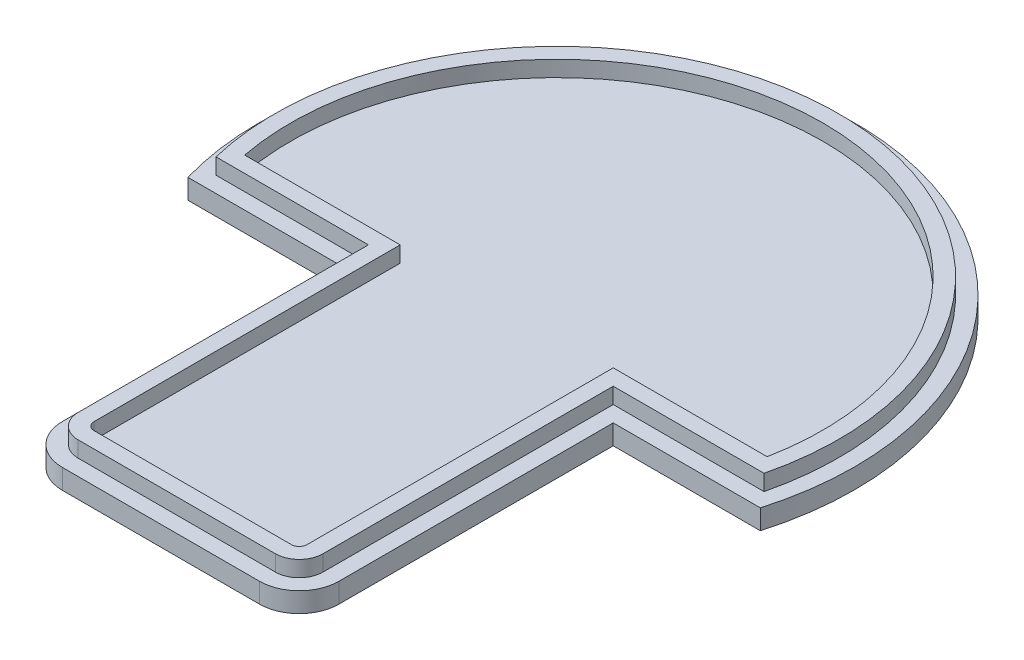
ISO-10303-21;
HEADER;
FILE_DESCRIPTION(('STEP AP214'),'2;1');
FILE_NAME('part.step','',(''),(''),'','','');
FILE_SCHEMA(('AUTOMOTIVE_DESIGN { 1 0 10303 214 1 1 1 1 }'));
ENDSEC;
DATA;
#1=APPLICATION_CONTEXT('core data for automotive mechanical design processes');
#2=APPLICATION_PROTOCOL_DEFINITION('international standard','automotive_design',2000,#1);
#3=PRODUCT_CONTEXT('',#1,'mechanical');
#4=PRODUCT('Part','Part','',(#3));
#5=PRODUCT_RELATED_PRODUCT_CATEGORY('part','',(#4));
#6=PRODUCT_DEFINITION_FORMATION('','',#4);
#7=PRODUCT_DEFINITION_CONTEXT('part definition',#1,'design');
#8=PRODUCT_DEFINITION('design','',#6,#7);
#9=PRODUCT_DEFINITION_SHAPE('','',#8);
#10=(LENGTH_UNIT() NAMED_UNIT(*) SI_UNIT(.MILLI.,.METRE.));
#11=(NAMED_UNIT(*) PLANE_ANGLE_UNIT() SI_UNIT($,.RADIAN.));
#12=(NAMED_UNIT(*) SI_UNIT($,.STERADIAN.) SOLID_ANGLE_UNIT());
#13=UNCERTAINTY_MEASURE_WITH_UNIT(LENGTH_MEASURE(1.E-05),#10,'distance_accuracy_value','');
#14=(GEOMETRIC_REPRESENTATION_CONTEXT(3) GLOBAL_UNCERTAINTY_ASSIGNED_CONTEXT((#13)) GLOBAL_UNIT_ASSIGNED_CONTEXT((#10,
#11,#12)) REPRESENTATION_CONTEXT('',''));
#15=CARTESIAN_POINT('',(0.,0.,0.));
#16=DIRECTION('',(0.,0.,1.));
#17=DIRECTION('',(1.,0.,0.));
#18=AXIS2_PLACEMENT_3D('',#15,#16,#17);
#19=CARTESIAN_POINT('',(0.,2.5,0.));
#20=DIRECTION('',(0.,1.,0.));
#21=DIRECTION('',(0.,0.,1.));
#22=AXIS2_PLACEMENT_3D('',#19,#20,#21);
#23=PLANE('',#22);
#24=DIRECTION('',(1.,0.,0.));
#25=VECTOR('',#24,1.);
#26=CARTESIAN_POINT('',(0.,2.5,49.9278059624544));
#27=LINE('',#26,#25);
#28=CARTESIAN_POINT('',(-12.3099330461355,2.5,49.9278059624544));
#29=VERTEX_POINT('',#28);
#30=CARTESIAN_POINT('',(12.5079192629976,2.5,49.9278059624544));
#31=VERTEX_POINT('',#30);
#32=EDGE_CURVE('E339',#29,#31,#27,.T.);
#33=ORIENTED_EDGE('',*,*,#32,.T.);
#34=CARTESIAN_POINT('',(12.5079192629976,2.5,44.9278059624544));
#35=DIRECTION('',(0.,1.,0.));
#36=DIRECTION('',(0.,0.,1.));
#37=AXIS2_PLACEMENT_3D('',#34,#35,#36);
#38=CIRCLE('',#37,5.);
#39=CARTESIAN_POINT('',(17.5079192629976,2.5,44.9278059624544));
#40=VERTEX_POINT('',#39);
#41=EDGE_CURVE('E11',#31,#40,#38,.T.);
#42=ORIENTED_EDGE('',*,*,#41,.T.);
#43=DIRECTION('',(0.,0.,1.));
#44=VECTOR('',#43,1.);
#45=CARTESIAN_POINT('',(17.5079192629976,2.5,0.));
#46=LINE('',#45,#44);
#47=CARTESIAN_POINT('',(17.5079192629976,2.5,10.4011322791848));
#48=VERTEX_POINT('',#47);
#49=EDGE_CURVE('E326',#48,#40,#46,.T.);
#50=ORIENTED_EDGE('',*,*,#49,.F.);
#51=DIRECTION('',(1.,0.,0.));
#52=VECTOR('',#51,1.);
#53=CARTESIAN_POINT('',(0.,2.5,10.4011322791848));
#54=LINE('',#53,#52);
#55=CARTESIAN_POINT('',(36.028689225545,2.5,10.4011322791848));
#56=VERTEX_POINT('',#55);
#57=EDGE_CURVE('E329',#48,#56,#54,.T.);
#58=ORIENTED_EDGE('',*,*,#57,.T.);
#59=CARTESIAN_POINT('',(0.,2.5,0.));
#60=DIRECTION('',(0.,1.,0.));
#61=DIRECTION('',(0.,0.,1.));
#62=AXIS2_PLACEMENT_3D('',#59,#60,#61);
#63=CIRCLE('',#62,37.5);
#64=CARTESIAN_POINT('',(-36.028689225545,2.5,10.4011322791848));
#65=VERTEX_POINT('',#64);
#66=EDGE_CURVE('E332',#56,#65,#63,.T.);
#67=ORIENTED_EDGE('',*,*,#66,.T.);
#68=DIRECTION('',(1.,0.,0.));
#69=VECTOR('',#68,1.);
#70=CARTESIAN_POINT('',(0.,2.5,10.4011322791848));
#71=LINE('',#70,#69);
#72=CARTESIAN_POINT('',(-17.3099330461355,2.5,10.4011322791848));
#73=VERTEX_POINT('',#72);
#74=EDGE_CURVE('E334',#65,#73,#71,.T.);
#75=ORIENTED_EDGE('',*,*,#74,.T.);
#76=DIRECTION('',(0.,0.,1.));
#77=VECTOR('',#76,1.);
#78=CARTESIAN_POINT('',(-17.3099330461355,2.5,0.));
#79=LINE('',#78,#77);
#80=CARTESIAN_POINT('',(-17.3099330461355,2.5,44.9278059624544));
#81=VERTEX_POINT('',#80);
#82=EDGE_CURVE('E336',#73,#81,#79,.T.);
#83=ORIENTED_EDGE('',*,*,#82,.T.);
#84=CARTESIAN_POINT('',(-12.3099330461355,2.5,44.9278059624544));
#85=DIRECTION('',(0.,1.,0.));
#86=DIRECTION('',(0.,0.,1.));
#87=AXIS2_PLACEMENT_3D('',#84,#85,#86);
#88=CIRCLE('',#87,5.);
#89=EDGE_CURVE('E373',#81,#29,#88,.T.);
#90=ORIENTED_EDGE('',*,*,#89,.T.);
#91=EDGE_LOOP('',(#33,#42,#50,#58,#67,#75,#83,#90));
#92=FACE_BOUND('',#91,.T.);
#93=DIRECTION('',(0.,0.,1.));
#94=VECTOR('',#93,1.);
#95=CARTESIAN_POINT('',(-15.3099330461355,2.5,0.));
#96=LINE('',#95,#94);
#97=CARTESIAN_POINT('',(-15.3099330461355,2.5,8.40113227918482));
#98=VERTEX_POINT('',#97);
#99=CARTESIAN_POINT('',(-15.3099330461355,2.5,44.9278059624544));
#100=VERTEX_POINT('',#99);
#101=EDGE_CURVE('E279',#98,#100,#96,.T.);
#102=ORIENTED_EDGE('',*,*,#101,.F.);
#103=DIRECTION('',(1.,0.,0.));
#104=VECTOR('',#103,1.);
#105=CARTESIAN_POINT('',(0.,2.5,8.40113227918482));
#106=LINE('',#105,#104);
#107=CARTESIAN_POINT('',(-34.4916073331998,2.5,8.40113227918482));
#108=VERTEX_POINT('',#107);
#109=EDGE_CURVE('E276',#108,#98,#106,.T.);
#110=ORIENTED_EDGE('',*,*,#109,.F.);
#111=CARTESIAN_POINT('',(0.,2.5,0.));
#112=DIRECTION('',(0.,1.,0.));
#113=DIRECTION('',(0.,0.,1.));
#114=AXIS2_PLACEMENT_3D('',#111,#112,#113);
#115=CIRCLE('',#114,35.5);
#116=CARTESIAN_POINT('',(34.4916073331998,2.5,8.40113227918482));
#117=VERTEX_POINT('',#116);
#118=EDGE_CURVE('E220',#117,#108,#115,.T.);
#119=ORIENTED_EDGE('',*,*,#118,.F.);
#120=DIRECTION('',(1.,0.,0.));
#121=VECTOR('',#120,1.);
#122=CARTESIAN_POINT('',(0.,2.5,8.40113227918482));
#123=LINE('',#122,#121);
#124=CARTESIAN_POINT('',(15.5079192629976,2.5,8.40113227918482));
#125=VERTEX_POINT('',#124);
#126=EDGE_CURVE('E291',#125,#117,#123,.T.);
#127=ORIENTED_EDGE('',*,*,#126,.F.);
#128=DIRECTION('',(0.,0.,-1.));
#129=VECTOR('',#128,1.);
#130=CARTESIAN_POINT('',(15.5079192629976,2.5,0.));
#131=LINE('',#130,#129);
#132=CARTESIAN_POINT('',(15.5079192629976,2.5,44.9278059624544));
#133=VERTEX_POINT('',#132);
#134=EDGE_CURVE('E289',#133,#125,#131,.T.);
#135=ORIENTED_EDGE('',*,*,#134,.F.);
#136=CARTESIAN_POINT('',(12.5079192629976,2.5,44.9278059624544));
#137=DIRECTION('',(0.,1.,0.));
#138=DIRECTION('',(0.,0.,1.));
#139=AXIS2_PLACEMENT_3D('',#136,#137,#138);
#140=CIRCLE('',#139,3.);
#141=CARTESIAN_POINT('',(12.5079192629976,2.5,47.9278059624544));
#142=VERTEX_POINT('',#141);
#143=EDGE_CURVE('E287',#142,#133,#140,.T.);
#144=ORIENTED_EDGE('',*,*,#143,.F.);
#145=DIRECTION('',(1.,0.,0.));
#146=VECTOR('',#145,1.);
#147=CARTESIAN_POINT('',(0.,2.5,47.9278059624544));
#148=LINE('',#147,#146);
#149=CARTESIAN_POINT('',(-12.3099330461355,2.5,47.9278059624544));
#150=VERTEX_POINT('',#149);
#151=EDGE_CURVE('E285',#150,#142,#148,.T.);
#152=ORIENTED_EDGE('',*,*,#151,.F.);
#153=CARTESIAN_POINT('',(-12.3099330461355,2.5,44.9278059624544));
#154=DIRECTION('',(0.,1.,0.));
#155=DIRECTION('',(0.,0.,1.));
#156=AXIS2_PLACEMENT_3D('',#153,#154,#155);
#157=CIRCLE('',#156,3.00000000000001);
#158=EDGE_CURVE('E282',#150,#100,#157,.F.);
#159=ORIENTED_EDGE('',*,*,#158,.T.);
#160=EDGE_LOOP('',(#102,#110,#119,#127,#135,#144,#152,#159));
#161=FACE_BOUND('',#160,.T.);
#162=ADVANCED_FACE('F37',(#92,#161),#23,.T.);
#163=CARTESIAN_POINT('',(17.5079192629976,2.5,0.));
#164=DIRECTION('',(1.,0.,0.));
#165=DIRECTION('',(0.,0.,-1.));
#166=AXIS2_PLACEMENT_3D('',#163,#164,#165);
#167=PLANE('',#166);
#168=ORIENTED_EDGE('',*,*,#49,.T.);
#169=DIRECTION('',(0.,-1.,0.));
#170=VECTOR('',#169,1.);
#171=CARTESIAN_POINT('',(17.5079192629976,0.,44.9278059624544));
#172=LINE('',#171,#170);
#173=CARTESIAN_POINT('',(17.5079192629976,0.,44.9278059624544));
#174=VERTEX_POINT('',#173);
#175=EDGE_CURVE('E375',#40,#174,#172,.T.);
#176=ORIENTED_EDGE('',*,*,#175,.T.);
#177=DIRECTION('',(0.,0.,1.));
#178=VECTOR('',#177,1.);
#179=CARTESIAN_POINT('',(17.5079192629976,0.,0.));
#180=LINE('',#179,#178);
#181=CARTESIAN_POINT('',(17.5079192629976,0.,10.4011322791848));
#182=VERTEX_POINT('',#181);
#183=EDGE_CURVE('E312',#182,#174,#180,.T.);
#184=ORIENTED_EDGE('',*,*,#183,.F.);
#185=DIRECTION('',(0.,-1.,0.));
#186=VECTOR('',#185,1.);
#187=CARTESIAN_POINT('',(17.5079192629976,2.5,10.4011322791848));
#188=LINE('',#187,#186);
#189=EDGE_CURVE('E364',#48,#182,#188,.T.);
#190=ORIENTED_EDGE('',*,*,#189,.F.);
#191=EDGE_LOOP('',(#168,#176,#184,#190));
#192=FACE_BOUND('',#191,.T.);
#193=ADVANCED_FACE('F394',(#192),#167,.T.);
#194=CARTESIAN_POINT('',(0.,2.5,10.4011322791848));
#195=DIRECTION('',(0.,0.,-1.));
#196=DIRECTION('',(-1.,0.,0.));
#197=AXIS2_PLACEMENT_3D('',#194,#195,#196);
#198=PLANE('',#197);
#199=DIRECTION('',(1.,0.,0.));
#200=VECTOR('',#199,1.);
#201=CARTESIAN_POINT('',(0.,0.,10.4011322791848));
#202=LINE('',#201,#200);
#203=CARTESIAN_POINT('',(36.028689225545,0.,10.4011322791848));
#204=VERTEX_POINT('',#203);
#205=EDGE_CURVE('E345',#182,#204,#202,.T.);
#206=ORIENTED_EDGE('',*,*,#205,.T.);
#207=DIRECTION('',(0.,-1.,0.));
#208=VECTOR('',#207,1.);
#209=CARTESIAN_POINT('',(36.028689225545,2.5,10.4011322791848));
#210=LINE('',#209,#208);
#211=EDGE_CURVE('E361',#56,#204,#210,.T.);
#212=ORIENTED_EDGE('',*,*,#211,.F.);
#213=ORIENTED_EDGE('',*,*,#57,.F.);
#214=ORIENTED_EDGE('',*,*,#189,.T.);
#215=EDGE_LOOP('',(#206,#212,#213,#214));
#216=FACE_BOUND('',#215,.T.);
#217=ADVANCED_FACE('F402',(#216),#198,.F.);
#218=CARTESIAN_POINT('',(0.,2.5,0.));
#219=DIRECTION('',(0.,-1.,0.));
#220=DIRECTION('',(0.,0.,-1.));
#221=AXIS2_PLACEMENT_3D('',#218,#219,#220);
#222=CYLINDRICAL_SURFACE('',#221,37.5);
#223=CARTESIAN_POINT('',(0.,0.,0.));
#224=DIRECTION('',(0.,1.,0.));
#225=DIRECTION('',(0.,0.,1.));
#226=AXIS2_PLACEMENT_3D('',#223,#224,#225);
#227=CIRCLE('',#226,37.5);
#228=CARTESIAN_POINT('',(-36.028689225545,0.,10.4011322791848));
#229=VERTEX_POINT('',#228);
#230=EDGE_CURVE('E347',#204,#229,#227,.T.);
#231=ORIENTED_EDGE('',*,*,#230,.T.);
#232=DIRECTION('',(0.,-1.,0.));
#233=VECTOR('',#232,1.);
#234=CARTESIAN_POINT('',(-36.028689225545,2.5,10.4011322791848));
#235=LINE('',#234,#233);
#236=EDGE_CURVE('E358',#65,#229,#235,.T.);
#237=ORIENTED_EDGE('',*,*,#236,.F.);
#238=ORIENTED_EDGE('',*,*,#66,.F.);
#239=ORIENTED_EDGE('',*,*,#211,.T.);
#240=EDGE_LOOP('',(#231,#237,#238,#239));
#241=FACE_BOUND('',#240,.T.);
#242=ADVANCED_FACE('F406',(#241),#222,.T.);
#243=CARTESIAN_POINT('',(0.,2.5,10.4011322791848));
#244=DIRECTION('',(0.,0.,-1.));
#245=DIRECTION('',(-1.,0.,0.));
#246=AXIS2_PLACEMENT_3D('',#243,#244,#245);
#247=PLANE('',#246);
#248=DIRECTION('',(1.,0.,0.));
#249=VECTOR('',#248,1.);
#250=CARTESIAN_POINT('',(0.,0.,10.4011322791848));
#251=LINE('',#250,#249);
#252=CARTESIAN_POINT('',(-17.3099330461355,0.,10.4011322791848));
#253=VERTEX_POINT('',#252);
#254=EDGE_CURVE('E349',#229,#253,#251,.T.);
#255=ORIENTED_EDGE('',*,*,#254,.T.);
#256=DIRECTION('',(0.,-1.,0.));
#257=VECTOR('',#256,1.);
#258=CARTESIAN_POINT('',(-17.3099330461355,2.5,10.4011322791848));
#259=LINE('',#258,#257);
#260=EDGE_CURVE('E342',#73,#253,#259,.T.);
#261=ORIENTED_EDGE('',*,*,#260,.F.);
#262=ORIENTED_EDGE('',*,*,#74,.F.);
#263=ORIENTED_EDGE('',*,*,#236,.T.);
#264=EDGE_LOOP('',(#255,#261,#262,#263));
#265=FACE_BOUND('',#264,.T.);
#266=ADVANCED_FACE('F412',(#265),#247,.F.);
#267=CARTESIAN_POINT('',(-17.3099330461355,2.5,0.));
#268=DIRECTION('',(1.,0.,0.));
#269=DIRECTION('',(0.,0.,-1.));
#270=AXIS2_PLACEMENT_3D('',#267,#268,#269);
#271=PLANE('',#270);
#272=DIRECTION('',(0.,0.,1.));
#273=VECTOR('',#272,1.);
#274=CARTESIAN_POINT('',(-17.3099330461355,0.,0.));
#275=LINE('',#274,#273);
#276=CARTESIAN_POINT('',(-17.3099330461355,0.,44.9278059624544));
#277=VERTEX_POINT('',#276);
#278=EDGE_CURVE('E351',#253,#277,#275,.T.);
#279=ORIENTED_EDGE('',*,*,#278,.T.);
#280=DIRECTION('',(0.,-1.,0.));
#281=VECTOR('',#280,1.);
#282=CARTESIAN_POINT('',(-17.3099330461355,2.5,44.9278059624544));
#283=LINE('',#282,#281);
#284=EDGE_CURVE('E371',#277,#81,#283,.F.);
#285=ORIENTED_EDGE('',*,*,#284,.T.);
#286=ORIENTED_EDGE('',*,*,#82,.F.);
#287=ORIENTED_EDGE('',*,*,#260,.T.);
#288=EDGE_LOOP('',(#279,#285,#286,#287));
#289=FACE_BOUND('',#288,.T.);
#290=ADVANCED_FACE('F415',(#289),#271,.F.);
#291=CARTESIAN_POINT('',(0.,2.5,49.9278059624544));
#292=DIRECTION('',(0.,0.,-1.));
#293=DIRECTION('',(-1.,0.,0.));
#294=AXIS2_PLACEMENT_3D('',#291,#292,#293);
#295=PLANE('',#294);
#296=DIRECTION('',(1.,0.,0.));
#297=VECTOR('',#296,1.);
#298=CARTESIAN_POINT('',(0.,0.,49.9278059624544));
#299=LINE('',#298,#297);
#300=CARTESIAN_POINT('',(-12.3099330461355,0.,49.9278059624544));
#301=VERTEX_POINT('',#300);
#302=CARTESIAN_POINT('',(12.5079192629976,0.,49.9278059624544));
#303=VERTEX_POINT('',#302);
#304=EDGE_CURVE('E330',#301,#303,#299,.T.);
#305=ORIENTED_EDGE('',*,*,#304,.T.);
#306=DIRECTION('',(0.,-1.,0.));
#307=VECTOR('',#306,1.);
#308=CARTESIAN_POINT('',(12.5079192629976,2.5,49.9278059624544));
#309=LINE('',#308,#307);
#310=EDGE_CURVE('E45',#303,#31,#309,.F.);
#311=ORIENTED_EDGE('',*,*,#310,.T.);
#312=ORIENTED_EDGE('',*,*,#32,.F.);
#313=DIRECTION('',(0.,-1.,0.));
#314=VECTOR('',#313,1.);
#315=CARTESIAN_POINT('',(-12.3099330461355,2.5,49.9278059624544));
#316=LINE('',#315,#314);
#317=EDGE_CURVE('E366',#29,#301,#316,.T.);
#318=ORIENTED_EDGE('',*,*,#317,.T.);
#319=EDGE_LOOP('',(#305,#311,#312,#318));
#320=FACE_BOUND('',#319,.T.);
#321=ADVANCED_FACE('F382',(#320),#295,.F.);
#322=CARTESIAN_POINT('',(0.,0.,0.));
#323=DIRECTION('',(0.,1.,0.));
#324=DIRECTION('',(0.,0.,1.));
#325=AXIS2_PLACEMENT_3D('',#322,#323,#324);
#326=PLANE('',#325);
#327=ORIENTED_EDGE('',*,*,#183,.T.);
#328=CARTESIAN_POINT('',(12.5079192629976,0.,44.9278059624544));
#329=DIRECTION('',(0.,1.,0.));
#330=DIRECTION('',(0.,0.,1.));
#331=AXIS2_PLACEMENT_3D('',#328,#329,#330);
#332=CIRCLE('',#331,5.);
#333=EDGE_CURVE('E378',#174,#303,#332,.F.);
#334=ORIENTED_EDGE('',*,*,#333,.T.);
#335=ORIENTED_EDGE('',*,*,#304,.F.);
#336=CARTESIAN_POINT('',(-12.3099330461355,0.,44.9278059624544));
#337=DIRECTION('',(0.,1.,0.));
#338=DIRECTION('',(0.,0.,1.));
#339=AXIS2_PLACEMENT_3D('',#336,#337,#338);
#340=CIRCLE('',#339,5.);
#341=EDGE_CURVE('E369',#301,#277,#340,.F.);
#342=ORIENTED_EDGE('',*,*,#341,.T.);
#343=ORIENTED_EDGE('',*,*,#278,.F.);
#344=ORIENTED_EDGE('',*,*,#254,.F.);
#345=ORIENTED_EDGE('',*,*,#230,.F.);
#346=ORIENTED_EDGE('',*,*,#205,.F.);
#347=EDGE_LOOP('',(#327,#334,#335,#342,#343,#344,#345,#346));
#348=FACE_BOUND('',#347,.T.);
#349=ADVANCED_FACE('F397',(#348),#326,.F.);
#350=CARTESIAN_POINT('',(-12.3099330461355,2.5,44.9278059624544));
#351=DIRECTION('',(0.,-1.,0.));
#352=DIRECTION('',(0.,0.,-1.));
#353=AXIS2_PLACEMENT_3D('',#350,#351,#352);
#354=CYLINDRICAL_SURFACE('',#353,5.);
#355=ORIENTED_EDGE('',*,*,#89,.F.);
#356=ORIENTED_EDGE('',*,*,#284,.F.);
#357=ORIENTED_EDGE('',*,*,#341,.F.);
#358=ORIENTED_EDGE('',*,*,#317,.F.);
#359=EDGE_LOOP('',(#355,#356,#357,#358));
#360=FACE_BOUND('',#359,.T.);
#361=ADVANCED_FACE('F418',(#360),#354,.T.);
#362=CARTESIAN_POINT('',(12.5079192629976,2.5,44.9278059624544));
#363=DIRECTION('',(0.,1.,0.));
#364=DIRECTION('',(0.,0.,1.));
#365=AXIS2_PLACEMENT_3D('',#362,#363,#364);
#366=CYLINDRICAL_SURFACE('',#365,5.);
#367=ORIENTED_EDGE('',*,*,#41,.F.);
#368=ORIENTED_EDGE('',*,*,#310,.F.);
#369=ORIENTED_EDGE('',*,*,#333,.F.);
#370=ORIENTED_EDGE('',*,*,#175,.F.);
#371=EDGE_LOOP('',(#367,#368,#369,#370));
#372=FACE_BOUND('',#371,.T.);
#373=ADVANCED_FACE('F39',(#372),#366,.T.);
#374=CARTESIAN_POINT('',(0.,4.5,8.40113227918482));
#375=DIRECTION('',(0.,0.,-1.));
#376=DIRECTION('',(-1.,0.,0.));
#377=AXIS2_PLACEMENT_3D('',#374,#375,#376);
#378=PLANE('',#377);
#379=ORIENTED_EDGE('',*,*,#109,.T.);
#380=DIRECTION('',(0.,-1.,0.));
#381=VECTOR('',#380,1.);
#382=CARTESIAN_POINT('',(-15.3099330461355,4.5,8.40113227918482));
#383=LINE('',#382,#381);
#384=CARTESIAN_POINT('',(-15.3099330461355,4.5,8.40113227918482));
#385=VERTEX_POINT('',#384);
#386=EDGE_CURVE('E310',#385,#98,#383,.T.);
#387=ORIENTED_EDGE('',*,*,#386,.F.);
#388=DIRECTION('',(1.,0.,0.));
#389=VECTOR('',#388,1.);
#390=CARTESIAN_POINT('',(0.,4.5,8.40113227918482));
#391=LINE('',#390,#389);
#392=CARTESIAN_POINT('',(-34.4916073331998,4.5,8.40113227918482));
#393=VERTEX_POINT('',#392);
#394=EDGE_CURVE('E239',#393,#385,#391,.T.);
#395=ORIENTED_EDGE('',*,*,#394,.F.);
#396=DIRECTION('',(0.,-1.,0.));
#397=VECTOR('',#396,1.);
#398=CARTESIAN_POINT('',(-34.4916073331998,4.5,8.40113227918482));
#399=LINE('',#398,#397);
#400=EDGE_CURVE('E208',#393,#108,#399,.T.);
#401=ORIENTED_EDGE('',*,*,#400,.T.);
#402=EDGE_LOOP('',(#379,#387,#395,#401));
#403=FACE_BOUND('',#402,.T.);
#404=ADVANCED_FACE('F424',(#403),#378,.F.);
#405=CARTESIAN_POINT('',(-15.3099330461355,4.5,0.));
#406=DIRECTION('',(1.,0.,0.));
#407=DIRECTION('',(0.,0.,-1.));
#408=AXIS2_PLACEMENT_3D('',#405,#406,#407);
#409=PLANE('',#408);
#410=ORIENTED_EDGE('',*,*,#101,.T.);
#411=DIRECTION('',(0.,-1.,0.));
#412=VECTOR('',#411,1.);
#413=CARTESIAN_POINT('',(-15.3099330461355,4.5,44.9278059624544));
#414=LINE('',#413,#412);
#415=CARTESIAN_POINT('',(-15.3099330461355,4.5,44.9278059624544));
#416=VERTEX_POINT('',#415);
#417=EDGE_CURVE('E308',#416,#100,#414,.T.);
#418=ORIENTED_EDGE('',*,*,#417,.F.);
#419=DIRECTION('',(0.,0.,1.));
#420=VECTOR('',#419,1.);
#421=CARTESIAN_POINT('',(-15.3099330461355,4.5,0.));
#422=LINE('',#421,#420);
#423=EDGE_CURVE('E242',#385,#416,#422,.T.);
#424=ORIENTED_EDGE('',*,*,#423,.F.);
#425=ORIENTED_EDGE('',*,*,#386,.T.);
#426=EDGE_LOOP('',(#410,#418,#424,#425));
#427=FACE_BOUND('',#426,.T.);
#428=ADVANCED_FACE('F507',(#427),#409,.F.);
#429=CARTESIAN_POINT('',(-12.3099330461355,4.5,44.9278059624544));
#430=DIRECTION('',(0.,-1.,0.));
#431=DIRECTION('',(0.,0.,-1.));
#432=AXIS2_PLACEMENT_3D('',#429,#430,#431);
#433=CYLINDRICAL_SURFACE('',#432,3.00000000000001);
#434=ORIENTED_EDGE('',*,*,#158,.F.);
#435=DIRECTION('',(0.,-1.,0.));
#436=VECTOR('',#435,1.);
#437=CARTESIAN_POINT('',(-12.3099330461355,4.5,47.9278059624544));
#438=LINE('',#437,#436);
#439=CARTESIAN_POINT('',(-12.3099330461355,4.5,47.9278059624544));
#440=VERTEX_POINT('',#439);
#441=EDGE_CURVE('E306',#440,#150,#438,.T.);
#442=ORIENTED_EDGE('',*,*,#441,.F.);
#443=CARTESIAN_POINT('',(-12.3099330461355,4.5,44.9278059624544));
#444=DIRECTION('',(0.,1.,0.));
#445=DIRECTION('',(0.,0.,1.));
#446=AXIS2_PLACEMENT_3D('',#443,#444,#445);
#447=CIRCLE('',#446,3.00000000000001);
#448=EDGE_CURVE('E244',#440,#416,#447,.F.);
#449=ORIENTED_EDGE('',*,*,#448,.T.);
#450=ORIENTED_EDGE('',*,*,#417,.T.);
#451=EDGE_LOOP('',(#434,#442,#449,#450));
#452=FACE_BOUND('',#451,.T.);
#453=ADVANCED_FACE('F504',(#452),#433,.T.);
#454=CARTESIAN_POINT('',(0.,4.5,47.9278059624544));
#455=DIRECTION('',(0.,0.,-1.));
#456=DIRECTION('',(-1.,0.,0.));
#457=AXIS2_PLACEMENT_3D('',#454,#455,#456);
#458=PLANE('',#457);
#459=ORIENTED_EDGE('',*,*,#151,.T.);
#460=DIRECTION('',(0.,-1.,0.));
#461=VECTOR('',#460,1.);
#462=CARTESIAN_POINT('',(12.5079192629976,4.5,47.9278059624544));
#463=LINE('',#462,#461);
#464=CARTESIAN_POINT('',(12.5079192629976,4.5,47.9278059624544));
#465=VERTEX_POINT('',#464);
#466=EDGE_CURVE('E303',#465,#142,#463,.T.);
#467=ORIENTED_EDGE('',*,*,#466,.F.);
#468=DIRECTION('',(1.,0.,0.));
#469=VECTOR('',#468,1.);
#470=CARTESIAN_POINT('',(0.,4.5,47.9278059624544));
#471=LINE('',#470,#469);
#472=EDGE_CURVE('E247',#440,#465,#471,.T.);
#473=ORIENTED_EDGE('',*,*,#472,.F.);
#474=ORIENTED_EDGE('',*,*,#441,.T.);
#475=EDGE_LOOP('',(#459,#467,#473,#474));
#476=FACE_BOUND('',#475,.T.);
#477=ADVANCED_FACE('F500',(#476),#458,.F.);
#478=CARTESIAN_POINT('',(12.5079192629976,4.5,44.9278059624544));
#479=DIRECTION('',(0.,-1.,0.));
#480=DIRECTION('',(0.,0.,-1.));
#481=AXIS2_PLACEMENT_3D('',#478,#479,#480);
#482=CYLINDRICAL_SURFACE('',#481,3.);
#483=ORIENTED_EDGE('',*,*,#143,.T.);
#484=DIRECTION('',(0.,-1.,0.));
#485=VECTOR('',#484,1.);
#486=CARTESIAN_POINT('',(15.5079192629976,4.5,44.9278059624544));
#487=LINE('',#486,#485);
#488=CARTESIAN_POINT('',(15.5079192629976,4.5,44.9278059624544));
#489=VERTEX_POINT('',#488);
#490=EDGE_CURVE('E300',#489,#133,#487,.T.);
#491=ORIENTED_EDGE('',*,*,#490,.F.);
#492=CARTESIAN_POINT('',(12.5079192629976,4.5,44.9278059624544));
#493=DIRECTION('',(0.,1.,0.));
#494=DIRECTION('',(0.,0.,1.));
#495=AXIS2_PLACEMENT_3D('',#492,#493,#494);
#496=CIRCLE('',#495,3.);
#497=EDGE_CURVE('E249',#465,#489,#496,.T.);
#498=ORIENTED_EDGE('',*,*,#497,.F.);
#499=ORIENTED_EDGE('',*,*,#466,.T.);
#500=EDGE_LOOP('',(#483,#491,#498,#499));
#501=FACE_BOUND('',#500,.T.);
#502=ADVANCED_FACE('F494',(#501),#482,.T.);
#503=CARTESIAN_POINT('',(15.5079192629976,4.5,0.));
#504=DIRECTION('',(-1.,0.,0.));
#505=DIRECTION('',(0.,0.,1.));
#506=AXIS2_PLACEMENT_3D('',#503,#504,#505);
#507=PLANE('',#506);
#508=ORIENTED_EDGE('',*,*,#134,.T.);
#509=DIRECTION('',(0.,-1.,0.));
#510=VECTOR('',#509,1.);
#511=CARTESIAN_POINT('',(15.5079192629976,4.5,8.40113227918482));
#512=LINE('',#511,#510);
#513=CARTESIAN_POINT('',(15.5079192629976,4.5,8.40113227918482));
#514=VERTEX_POINT('',#513);
#515=EDGE_CURVE('E297',#514,#125,#512,.T.);
#516=ORIENTED_EDGE('',*,*,#515,.F.);
#517=DIRECTION('',(0.,0.,-1.));
#518=VECTOR('',#517,1.);
#519=CARTESIAN_POINT('',(15.5079192629976,4.5,0.));
#520=LINE('',#519,#518);
#521=EDGE_CURVE('E251',#489,#514,#520,.T.);
#522=ORIENTED_EDGE('',*,*,#521,.F.);
#523=ORIENTED_EDGE('',*,*,#490,.T.);
#524=EDGE_LOOP('',(#508,#516,#522,#523));
#525=FACE_BOUND('',#524,.T.);
#526=ADVANCED_FACE('F488',(#525),#507,.F.);
#527=CARTESIAN_POINT('',(0.,4.5,8.40113227918482));
#528=DIRECTION('',(0.,0.,-1.));
#529=DIRECTION('',(-1.,0.,0.));
#530=AXIS2_PLACEMENT_3D('',#527,#528,#529);
#531=PLANE('',#530);
#532=ORIENTED_EDGE('',*,*,#126,.T.);
#533=DIRECTION('',(0.,-1.,0.));
#534=VECTOR('',#533,1.);
#535=CARTESIAN_POINT('',(34.4916073331998,4.5,8.40113227918482));
#536=LINE('',#535,#534);
#537=CARTESIAN_POINT('',(34.4916073331998,4.5,8.40113227918482));
#538=VERTEX_POINT('',#537);
#539=EDGE_CURVE('E60',#538,#117,#536,.T.);
#540=ORIENTED_EDGE('',*,*,#539,.F.);
#541=DIRECTION('',(1.,0.,0.));
#542=VECTOR('',#541,1.);
#543=CARTESIAN_POINT('',(0.,4.5,8.40113227918482));
#544=LINE('',#543,#542);
#545=EDGE_CURVE('E253',#514,#538,#544,.T.);
#546=ORIENTED_EDGE('',*,*,#545,.F.);
#547=ORIENTED_EDGE('',*,*,#515,.T.);
#548=EDGE_LOOP('',(#532,#540,#546,#547));
#549=FACE_BOUND('',#548,.T.);
#550=ADVANCED_FACE('F484',(#549),#531,.F.);
#551=CARTESIAN_POINT('',(0.,4.5,0.));
#552=DIRECTION('',(0.,-1.,0.));
#553=DIRECTION('',(0.,0.,-1.));
#554=AXIS2_PLACEMENT_3D('',#551,#552,#553);
#555=CYLINDRICAL_SURFACE('',#554,33.5);
#556=CARTESIAN_POINT('',(0.,2.5,0.));
#557=DIRECTION('',(0.,1.,0.));
#558=DIRECTION('',(0.,0.,1.));
#559=AXIS2_PLACEMENT_3D('',#556,#557,#558);
#560=CIRCLE('',#559,33.5);
#561=CARTESIAN_POINT('',(32.8827539227538,2.5,6.40113227918482));
#562=VERTEX_POINT('',#561);
#563=CARTESIAN_POINT('',(-32.8827539227538,2.5,6.40113227918482));
#564=VERTEX_POINT('',#563);
#565=EDGE_CURVE('E203',#562,#564,#560,.T.);
#566=ORIENTED_EDGE('',*,*,#565,.F.);
#567=DIRECTION('',(0.,-1.,0.));
#568=VECTOR('',#567,1.);
#569=CARTESIAN_POINT('',(32.8827539227538,4.5,6.40113227918482));
#570=LINE('',#569,#568);
#571=CARTESIAN_POINT('',(32.8827539227538,4.5,6.40113227918482));
#572=VERTEX_POINT('',#571);
#573=EDGE_CURVE('E198',#572,#562,#570,.T.);
#574=ORIENTED_EDGE('',*,*,#573,.F.);
#575=CARTESIAN_POINT('',(0.,4.5,0.));
#576=DIRECTION('',(0.,1.,0.));
#577=DIRECTION('',(0.,0.,1.));
#578=AXIS2_PLACEMENT_3D('',#575,#576,#577);
#579=CIRCLE('',#578,33.5);
#580=CARTESIAN_POINT('',(-32.8827539227538,4.5,6.40113227918482));
#581=VERTEX_POINT('',#580);
#582=EDGE_CURVE('E201',#572,#581,#579,.T.);
#583=ORIENTED_EDGE('',*,*,#582,.T.);
#584=DIRECTION('',(0.,-1.,0.));
#585=VECTOR('',#584,1.);
#586=CARTESIAN_POINT('',(-32.8827539227538,4.5,6.40113227918482));
#587=LINE('',#586,#585);
#588=EDGE_CURVE('E257',#581,#564,#587,.T.);
#589=ORIENTED_EDGE('',*,*,#588,.T.);
#590=EDGE_LOOP('',(#566,#574,#583,#589));
#591=FACE_BOUND('',#590,.T.);
#592=ADVANCED_FACE('F200',(#591),#555,.F.);
#593=CARTESIAN_POINT('',(0.,4.5,6.40113227918482));
#594=DIRECTION('',(0.,0.,-1.));
#595=DIRECTION('',(-1.,0.,0.));
#596=AXIS2_PLACEMENT_3D('',#593,#594,#595);
#597=PLANE('',#596);
#598=DIRECTION('',(1.,0.,0.));
#599=VECTOR('',#598,1.);
#600=CARTESIAN_POINT('',(0.,2.5,6.40113227918482));
#601=LINE('',#600,#599);
#602=CARTESIAN_POINT('',(13.5079192629976,2.5,6.40113227918482));
#603=VERTEX_POINT('',#602);
#604=EDGE_CURVE('E259',#603,#562,#601,.T.);
#605=ORIENTED_EDGE('',*,*,#604,.F.);
#606=DIRECTION('',(0.,-1.,0.));
#607=VECTOR('',#606,1.);
#608=CARTESIAN_POINT('',(13.5079192629976,4.5,6.40113227918482));
#609=LINE('',#608,#607);
#610=CARTESIAN_POINT('',(13.5079192629976,4.5,6.40113227918482));
#611=VERTEX_POINT('',#610);
#612=EDGE_CURVE('E209',#611,#603,#609,.T.);
#613=ORIENTED_EDGE('',*,*,#612,.F.);
#614=DIRECTION('',(1.,0.,0.));
#615=VECTOR('',#614,1.);
#616=CARTESIAN_POINT('',(0.,4.5,6.40113227918482));
#617=LINE('',#616,#615);
#618=EDGE_CURVE('E215',#611,#572,#617,.T.);
#619=ORIENTED_EDGE('',*,*,#618,.T.);
#620=ORIENTED_EDGE('',*,*,#573,.T.);
#621=EDGE_LOOP('',(#605,#613,#619,#620));
#622=FACE_BOUND('',#621,.T.);
#623=ADVANCED_FACE('F222',(#622),#597,.T.);
#624=CARTESIAN_POINT('',(13.5079192629976,4.5,0.));
#625=DIRECTION('',(1.,0.,0.));
#626=DIRECTION('',(0.,0.,-1.));
#627=AXIS2_PLACEMENT_3D('',#624,#625,#626);
#628=PLANE('',#627);
#629=DIRECTION('',(0.,0.,1.));
#630=VECTOR('',#629,1.);
#631=CARTESIAN_POINT('',(13.5079192629976,2.5,0.));
#632=LINE('',#631,#630);
#633=CARTESIAN_POINT('',(13.5079192629976,2.5,44.9278059624544));
#634=VERTEX_POINT('',#633);
#635=EDGE_CURVE('E261',#603,#634,#632,.T.);
#636=ORIENTED_EDGE('',*,*,#635,.T.);
#637=DIRECTION('',(0.,-1.,0.));
#638=VECTOR('',#637,1.);
#639=CARTESIAN_POINT('',(13.5079192629976,4.5,44.9278059624544));
#640=LINE('',#639,#638);
#641=CARTESIAN_POINT('',(13.5079192629976,4.5,44.9278059624544));
#642=VERTEX_POINT('',#641);
#643=EDGE_CURVE('E322',#642,#634,#640,.T.);
#644=ORIENTED_EDGE('',*,*,#643,.F.);
#645=DIRECTION('',(0.,0.,1.));
#646=VECTOR('',#645,1.);
#647=CARTESIAN_POINT('',(13.5079192629976,4.5,0.));
#648=LINE('',#647,#646);
#649=EDGE_CURVE('E224',#611,#642,#648,.T.);
#650=ORIENTED_EDGE('',*,*,#649,.F.);
#651=ORIENTED_EDGE('',*,*,#612,.T.);
#652=EDGE_LOOP('',(#636,#644,#650,#651));
#653=FACE_BOUND('',#652,.T.);
#654=ADVANCED_FACE('F446',(#653),#628,.F.);
#655=CARTESIAN_POINT('',(12.5079192629976,4.5,44.9278059624544));
#656=DIRECTION('',(0.,-1.,0.));
#657=DIRECTION('',(0.,0.,-1.));
#658=AXIS2_PLACEMENT_3D('',#655,#656,#657);
#659=CYLINDRICAL_SURFACE('',#658,1.);
#660=CARTESIAN_POINT('',(12.5079192629976,2.5,44.9278059624544));
#661=DIRECTION('',(0.,1.,0.));
#662=DIRECTION('',(0.,0.,1.));
#663=AXIS2_PLACEMENT_3D('',#660,#661,#662);
#664=CIRCLE('',#663,1.);
#665=CARTESIAN_POINT('',(12.5079192629976,2.5,45.9278059624544));
#666=VERTEX_POINT('',#665);
#667=EDGE_CURVE('E263',#634,#666,#664,.F.);
#668=ORIENTED_EDGE('',*,*,#667,.T.);
#669=DIRECTION('',(0.,-1.,0.));
#670=VECTOR('',#669,1.);
#671=CARTESIAN_POINT('',(12.5079192629976,4.5,45.9278059624544));
#672=LINE('',#671,#670);
#673=CARTESIAN_POINT('',(12.5079192629976,4.5,45.9278059624544));
#674=VERTEX_POINT('',#673);
#675=EDGE_CURVE('E320',#674,#666,#672,.T.);
#676=ORIENTED_EDGE('',*,*,#675,.F.);
#677=CARTESIAN_POINT('',(12.5079192629976,4.5,44.9278059624544));
#678=DIRECTION('',(0.,1.,0.));
#679=DIRECTION('',(0.,0.,1.));
#680=AXIS2_PLACEMENT_3D('',#677,#678,#679);
#681=CIRCLE('',#680,1.);
#682=EDGE_CURVE('E226',#642,#674,#681,.F.);
#683=ORIENTED_EDGE('',*,*,#682,.F.);
#684=ORIENTED_EDGE('',*,*,#643,.T.);
#685=EDGE_LOOP('',(#668,#676,#683,#684));
#686=FACE_BOUND('',#685,.T.);
#687=ADVANCED_FACE('F449',(#686),#659,.F.);
#688=CARTESIAN_POINT('',(0.,4.5,45.9278059624544));
#689=DIRECTION('',(0.,0.,-1.));
#690=DIRECTION('',(-1.,0.,0.));
#691=AXIS2_PLACEMENT_3D('',#688,#689,#690);
#692=PLANE('',#691);
#693=DIRECTION('',(1.,0.,0.));
#694=VECTOR('',#693,1.);
#695=CARTESIAN_POINT('',(0.,2.5,45.9278059624544));
#696=LINE('',#695,#694);
#697=CARTESIAN_POINT('',(-12.3099330461355,2.5,45.9278059624544));
#698=VERTEX_POINT('',#697);
#699=EDGE_CURVE('E266',#698,#666,#696,.T.);
#700=ORIENTED_EDGE('',*,*,#699,.F.);
#701=DIRECTION('',(0.,-1.,0.));
#702=VECTOR('',#701,1.);
#703=CARTESIAN_POINT('',(-12.3099330461355,4.5,45.9278059624544));
#704=LINE('',#703,#702);
#705=CARTESIAN_POINT('',(-12.3099330461355,4.5,45.9278059624544));
#706=VERTEX_POINT('',#705);
#707=EDGE_CURVE('E318',#706,#698,#704,.T.);
#708=ORIENTED_EDGE('',*,*,#707,.F.);
#709=DIRECTION('',(1.,0.,0.));
#710=VECTOR('',#709,1.);
#711=CARTESIAN_POINT('',(0.,4.5,45.9278059624544));
#712=LINE('',#711,#710);
#713=EDGE_CURVE('E230',#706,#674,#712,.T.);
#714=ORIENTED_EDGE('',*,*,#713,.T.);
#715=ORIENTED_EDGE('',*,*,#675,.T.);
#716=EDGE_LOOP('',(#700,#708,#714,#715));
#717=FACE_BOUND('',#716,.T.);
#718=ADVANCED_FACE('F456',(#717),#692,.T.);
#719=CARTESIAN_POINT('',(-12.3099330461355,4.5,44.9278059624544));
#720=DIRECTION('',(0.,-1.,0.));
#721=DIRECTION('',(0.,0.,-1.));
#722=AXIS2_PLACEMENT_3D('',#719,#720,#721);
#723=CYLINDRICAL_SURFACE('',#722,0.999999999999992);
#724=CARTESIAN_POINT('',(-12.3099330461355,2.5,44.9278059624544));
#725=DIRECTION('',(0.,1.,0.));
#726=DIRECTION('',(0.,0.,1.));
#727=AXIS2_PLACEMENT_3D('',#724,#725,#726);
#728=CIRCLE('',#727,0.999999999999992);
#729=CARTESIAN_POINT('',(-13.3099330461355,2.5,44.9278059624544));
#730=VERTEX_POINT('',#729);
#731=EDGE_CURVE('E269',#698,#730,#728,.F.);
#732=ORIENTED_EDGE('',*,*,#731,.T.);
#733=DIRECTION('',(0.,-1.,0.));
#734=VECTOR('',#733,1.);
#735=CARTESIAN_POINT('',(-13.3099330461355,4.5,44.9278059624544));
#736=LINE('',#735,#734);
#737=CARTESIAN_POINT('',(-13.3099330461355,4.5,44.9278059624544));
#738=VERTEX_POINT('',#737);
#739=EDGE_CURVE('E316',#738,#730,#736,.T.);
#740=ORIENTED_EDGE('',*,*,#739,.F.);
#741=CARTESIAN_POINT('',(-12.3099330461355,4.5,44.9278059624544));
#742=DIRECTION('',(0.,1.,0.));
#743=DIRECTION('',(0.,0.,1.));
#744=AXIS2_PLACEMENT_3D('',#741,#742,#743);
#745=CIRCLE('',#744,0.999999999999992);
#746=EDGE_CURVE('E233',#706,#738,#745,.F.);
#747=ORIENTED_EDGE('',*,*,#746,.F.);
#748=ORIENTED_EDGE('',*,*,#707,.T.);
#749=EDGE_LOOP('',(#732,#740,#747,#748));
#750=FACE_BOUND('',#749,.T.);
#751=ADVANCED_FACE('F459',(#750),#723,.F.);
#752=CARTESIAN_POINT('',(-13.3099330461355,4.5,0.));
#753=DIRECTION('',(1.,0.,0.));
#754=DIRECTION('',(0.,0.,-1.));
#755=AXIS2_PLACEMENT_3D('',#752,#753,#754);
#756=PLANE('',#755);
#757=DIRECTION('',(0.,0.,1.));
#758=VECTOR('',#757,1.);
#759=CARTESIAN_POINT('',(-13.3099330461355,2.5,0.));
#760=LINE('',#759,#758);
#761=CARTESIAN_POINT('',(-13.3099330461355,2.5,6.40113227918482));
#762=VERTEX_POINT('',#761);
#763=EDGE_CURVE('E52',#762,#730,#760,.T.);
#764=ORIENTED_EDGE('',*,*,#763,.F.);
#765=DIRECTION('',(0.,-1.,0.));
#766=VECTOR('',#765,1.);
#767=CARTESIAN_POINT('',(-13.3099330461355,4.5,6.40113227918482));
#768=LINE('',#767,#766);
#769=CARTESIAN_POINT('',(-13.3099330461355,4.5,6.40113227918482));
#770=VERTEX_POINT('',#769);
#771=EDGE_CURVE('E314',#770,#762,#768,.T.);
#772=ORIENTED_EDGE('',*,*,#771,.F.);
#773=DIRECTION('',(0.,0.,1.));
#774=VECTOR('',#773,1.);
#775=CARTESIAN_POINT('',(-13.3099330461355,4.5,0.));
#776=LINE('',#775,#774);
#777=EDGE_CURVE('E235',#770,#738,#776,.T.);
#778=ORIENTED_EDGE('',*,*,#777,.T.);
#779=ORIENTED_EDGE('',*,*,#739,.T.);
#780=EDGE_LOOP('',(#764,#772,#778,#779));
#781=FACE_BOUND('',#780,.T.);
#782=ADVANCED_FACE('F460',(#781),#756,.T.);
#783=CARTESIAN_POINT('',(0.,4.5,6.40113227918482));
#784=DIRECTION('',(0.,0.,1.));
#785=DIRECTION('',(1.,0.,0.));
#786=AXIS2_PLACEMENT_3D('',#783,#784,#785);
#787=PLANE('',#786);
#788=DIRECTION('',(-1.,0.,0.));
#789=VECTOR('',#788,1.);
#790=CARTESIAN_POINT('',(0.,2.5,6.40113227918482));
#791=LINE('',#790,#789);
#792=EDGE_CURVE('E273',#762,#564,#791,.T.);
#793=ORIENTED_EDGE('',*,*,#792,.T.);
#794=ORIENTED_EDGE('',*,*,#588,.F.);
#795=DIRECTION('',(-1.,0.,0.));
#796=VECTOR('',#795,1.);
#797=CARTESIAN_POINT('',(0.,4.5,6.40113227918482));
#798=LINE('',#797,#796);
#799=EDGE_CURVE('E218',#770,#581,#798,.T.);
#800=ORIENTED_EDGE('',*,*,#799,.F.);
#801=ORIENTED_EDGE('',*,*,#771,.T.);
#802=EDGE_LOOP('',(#793,#794,#800,#801));
#803=FACE_BOUND('',#802,.T.);
#804=ADVANCED_FACE('F462',(#803),#787,.F.);
#805=CARTESIAN_POINT('',(0.,4.5,0.));
#806=DIRECTION('',(0.,-1.,0.));
#807=DIRECTION('',(0.,0.,-1.));
#808=AXIS2_PLACEMENT_3D('',#805,#806,#807);
#809=CYLINDRICAL_SURFACE('',#808,35.5);
#810=ORIENTED_EDGE('',*,*,#118,.T.);
#811=ORIENTED_EDGE('',*,*,#400,.F.);
#812=CARTESIAN_POINT('',(0.,4.5,0.));
#813=DIRECTION('',(0.,1.,0.));
#814=DIRECTION('',(0.,0.,1.));
#815=AXIS2_PLACEMENT_3D('',#812,#813,#814);
#816=CIRCLE('',#815,35.5);
#817=EDGE_CURVE('E255',#538,#393,#816,.T.);
#818=ORIENTED_EDGE('',*,*,#817,.F.);
#819=ORIENTED_EDGE('',*,*,#539,.T.);
#820=EDGE_LOOP('',(#810,#811,#818,#819));
#821=FACE_BOUND('',#820,.T.);
#822=ADVANCED_FACE('F439',(#821),#809,.T.);
#823=CARTESIAN_POINT('',(0.,4.5,0.));
#824=DIRECTION('',(0.,1.,0.));
#825=DIRECTION('',(0.,0.,1.));
#826=AXIS2_PLACEMENT_3D('',#823,#824,#825);
#827=PLANE('',#826);
#828=ORIENTED_EDGE('',*,*,#582,.F.);
#829=ORIENTED_EDGE('',*,*,#618,.F.);
#830=ORIENTED_EDGE('',*,*,#649,.T.);
#831=ORIENTED_EDGE('',*,*,#682,.T.);
#832=ORIENTED_EDGE('',*,*,#713,.F.);
#833=ORIENTED_EDGE('',*,*,#746,.T.);
#834=ORIENTED_EDGE('',*,*,#777,.F.);
#835=ORIENTED_EDGE('',*,*,#799,.T.);
#836=EDGE_LOOP('',(#828,#829,#830,#831,#832,#833,#834,#835));
#837=FACE_BOUND('',#836,.T.);
#838=ORIENTED_EDGE('',*,*,#394,.T.);
#839=ORIENTED_EDGE('',*,*,#423,.T.);
#840=ORIENTED_EDGE('',*,*,#448,.F.);
#841=ORIENTED_EDGE('',*,*,#472,.T.);
#842=ORIENTED_EDGE('',*,*,#497,.T.);
#843=ORIENTED_EDGE('',*,*,#521,.T.);
#844=ORIENTED_EDGE('',*,*,#545,.T.);
#845=ORIENTED_EDGE('',*,*,#817,.T.);
#846=EDGE_LOOP('',(#838,#839,#840,#841,#842,#843,#844,#845));
#847=FACE_BOUND('',#846,.T.);
#848=ADVANCED_FACE('F213',(#837,#847),#827,.T.);
#849=ORIENTED_EDGE('',*,*,#565,.T.);
#850=ORIENTED_EDGE('',*,*,#792,.F.);
#851=ORIENTED_EDGE('',*,*,#763,.T.);
#852=ORIENTED_EDGE('',*,*,#731,.F.);
#853=ORIENTED_EDGE('',*,*,#699,.T.);
#854=ORIENTED_EDGE('',*,*,#667,.F.);
#855=ORIENTED_EDGE('',*,*,#635,.F.);
#856=ORIENTED_EDGE('',*,*,#604,.T.);
#857=EDGE_LOOP('',(#849,#850,#851,#852,#853,#854,#855,#856));
#858=FACE_BOUND('',#857,.T.);
#859=ADVANCED_FACE('F429',(#858),#23,.T.);
#860=CLOSED_SHELL('',(#162,#193,#217,#242,#266,#290,#321,#349,#361,#373,#404,#428,#453,#477,
#502,#526,#550,#592,#623,#654,#687,#718,#751,#782,#804,#822,#848,#859));
#861=MANIFOLD_SOLID_BREP('B2',#860);
#862=ADVANCED_BREP_SHAPE_REPRESENTATION('',(#18,#861),#14);
#863=SHAPE_DEFINITION_REPRESENTATION(#9,#862);
ENDSEC;
END-ISO-10303-21;
